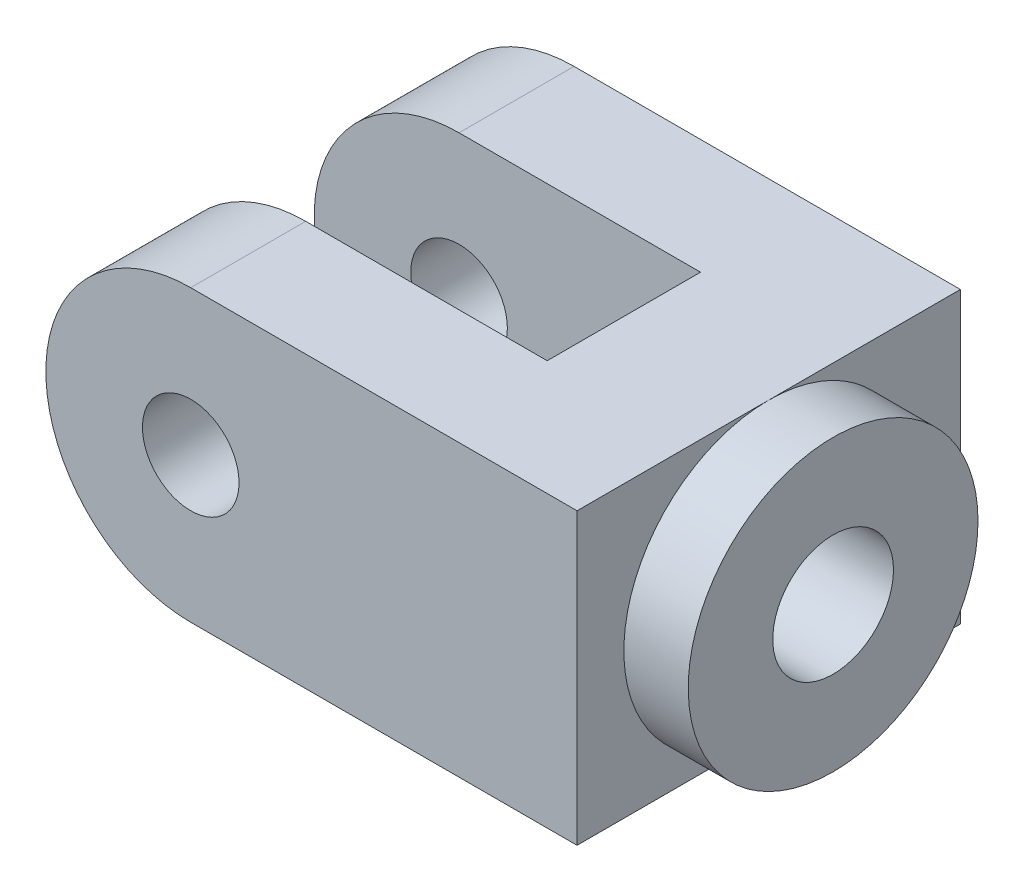
ISO-10303-21;
HEADER;
FILE_DESCRIPTION(('STEP AP214'),'2;1');
FILE_NAME('part.step','',(''),(''),'','','');
FILE_SCHEMA(('AUTOMOTIVE_DESIGN { 1 0 10303 214 1 1 1 1 }'));
ENDSEC;
DATA;
#1=APPLICATION_CONTEXT('core data for automotive mechanical design processes');
#2=APPLICATION_PROTOCOL_DEFINITION('international standard','automotive_design',2000,#1);
#3=PRODUCT_CONTEXT('',#1,'mechanical');
#4=PRODUCT('Part','Part','',(#3));
#5=PRODUCT_RELATED_PRODUCT_CATEGORY('part','',(#4));
#6=PRODUCT_DEFINITION_FORMATION('','',#4);
#7=PRODUCT_DEFINITION_CONTEXT('part definition',#1,'design');
#8=PRODUCT_DEFINITION('design','',#6,#7);
#9=PRODUCT_DEFINITION_SHAPE('','',#8);
#10=(LENGTH_UNIT() NAMED_UNIT(*) SI_UNIT(.MILLI.,.METRE.));
#11=(NAMED_UNIT(*) PLANE_ANGLE_UNIT() SI_UNIT($,.RADIAN.));
#12=(NAMED_UNIT(*) SI_UNIT($,.STERADIAN.) SOLID_ANGLE_UNIT());
#13=UNCERTAINTY_MEASURE_WITH_UNIT(LENGTH_MEASURE(1.E-05),#10,'distance_accuracy_value','');
#14=(GEOMETRIC_REPRESENTATION_CONTEXT(3) GLOBAL_UNCERTAINTY_ASSIGNED_CONTEXT((#13)) GLOBAL_UNIT_ASSIGNED_CONTEXT((#10,
#11,#12)) REPRESENTATION_CONTEXT('',''));
#15=CARTESIAN_POINT('',(0.,0.,0.));
#16=DIRECTION('',(0.,0.,1.));
#17=DIRECTION('',(1.,0.,0.));
#18=AXIS2_PLACEMENT_3D('',#15,#16,#17);
#19=CARTESIAN_POINT('',(66.,-36.,47.625));
#20=DIRECTION('',(-1.,0.,0.));
#21=DIRECTION('',(0.,0.,1.));
#22=AXIS2_PLACEMENT_3D('',#19,#20,#21);
#23=PLANE('',#22);
#24=CARTESIAN_POINT('',(66.,0.,0.));
#25=DIRECTION('',(1.,0.,0.));
#26=DIRECTION('',(0.,0.,-1.));
#27=AXIS2_PLACEMENT_3D('',#24,#25,#26);
#28=CIRCLE('',#27,36.);
#29=CARTESIAN_POINT('',(66.,36.,0.));
#30=VERTEX_POINT('',#29);
#31=CARTESIAN_POINT('',(66.,-36.,0.));
#32=VERTEX_POINT('',#31);
#33=EDGE_CURVE('E45',#30,#32,#28,.T.);
#34=ORIENTED_EDGE('',*,*,#33,.F.);
#35=DIRECTION('',(0.,0.,-1.));
#36=VECTOR('',#35,1.);
#37=CARTESIAN_POINT('',(66.,36.,47.625));
#38=LINE('',#37,#36);
#39=CARTESIAN_POINT('',(66.,36.,47.625));
#40=VERTEX_POINT('',#39);
#41=EDGE_CURVE('E107',#40,#30,#38,.T.);
#42=ORIENTED_EDGE('',*,*,#41,.F.);
#43=DIRECTION('',(0.,1.,0.));
#44=VECTOR('',#43,1.);
#45=CARTESIAN_POINT('',(66.,-36.,47.625));
#46=LINE('',#45,#44);
#47=CARTESIAN_POINT('',(66.,-36.,47.625));
#48=VERTEX_POINT('',#47);
#49=EDGE_CURVE('E238',#48,#40,#46,.T.);
#50=ORIENTED_EDGE('',*,*,#49,.F.);
#51=DIRECTION('',(0.,0.,-1.));
#52=VECTOR('',#51,1.);
#53=CARTESIAN_POINT('',(66.,-36.,47.625));
#54=LINE('',#53,#52);
#55=EDGE_CURVE('E123',#48,#32,#54,.T.);
#56=ORIENTED_EDGE('',*,*,#55,.T.);
#57=EDGE_LOOP('',(#34,#42,#50,#56));
#58=FACE_BOUND('',#57,.T.);
#59=ADVANCED_FACE('F34',(#58),#23,.F.);
#60=CARTESIAN_POINT('',(-30.,0.,389.175429799012));
#61=DIRECTION('',(0.,0.,-1.));
#62=DIRECTION('',(-1.,0.,0.));
#63=AXIS2_PLACEMENT_3D('',#60,#61,#62);
#64=CYLINDRICAL_SURFACE('',#63,36.0000000000001);
#65=DIRECTION('',(0.,0.,-1.));
#66=VECTOR('',#65,1.);
#67=CARTESIAN_POINT('',(-30.,36.,389.175429799012));
#68=LINE('',#67,#66);
#69=CARTESIAN_POINT('',(-30.,36.,47.625));
#70=VERTEX_POINT('',#69);
#71=CARTESIAN_POINT('',(-30.,36.,19.05));
#72=VERTEX_POINT('',#71);
#73=EDGE_CURVE('E234',#70,#72,#68,.T.);
#74=ORIENTED_EDGE('',*,*,#73,.T.);
#75=CARTESIAN_POINT('',(-30.,0.,19.05));
#76=DIRECTION('',(0.,0.,1.));
#77=DIRECTION('',(1.,0.,0.));
#78=AXIS2_PLACEMENT_3D('',#75,#76,#77);
#79=CIRCLE('',#78,36.0000000000001);
#80=CARTESIAN_POINT('',(-30.,-36.0000000000001,19.05));
#81=VERTEX_POINT('',#80);
#82=EDGE_CURVE('E227',#72,#81,#79,.T.);
#83=ORIENTED_EDGE('',*,*,#82,.T.);
#84=DIRECTION('',(0.,0.,-1.));
#85=VECTOR('',#84,1.);
#86=CARTESIAN_POINT('',(-30.0000030536262,-35.9999999999999,389.175429799012));
#87=LINE('',#86,#85);
#88=CARTESIAN_POINT('',(-30.,-36.,47.625));
#89=VERTEX_POINT('',#88);
#90=EDGE_CURVE('E230',#89,#81,#87,.T.);
#91=ORIENTED_EDGE('',*,*,#90,.F.);
#92=CARTESIAN_POINT('',(-30.,0.,47.625));
#93=DIRECTION('',(0.,0.,-1.));
#94=DIRECTION('',(-1.,0.,0.));
#95=AXIS2_PLACEMENT_3D('',#92,#93,#94);
#96=CIRCLE('',#95,36.0000000000001);
#97=EDGE_CURVE('E232',#70,#89,#96,.F.);
#98=ORIENTED_EDGE('',*,*,#97,.F.);
#99=EDGE_LOOP('',(#74,#83,#91,#98));
#100=FACE_BOUND('',#99,.T.);
#101=ADVANCED_FACE('F149',(#100),#64,.T.);
#102=CARTESIAN_POINT('',(-30.,0.,-19.05));
#103=DIRECTION('',(0.,0.,-1.));
#104=DIRECTION('',(-1.,0.,0.));
#105=AXIS2_PLACEMENT_3D('',#102,#103,#104);
#106=CIRCLE('',#105,36.0000000000001);
#107=CARTESIAN_POINT('',(-30.,-36.0000000000001,-19.05));
#108=VERTEX_POINT('',#107);
#109=CARTESIAN_POINT('',(-30.,36.,-19.05));
#110=VERTEX_POINT('',#109);
#111=EDGE_CURVE('E224',#108,#110,#106,.T.);
#112=ORIENTED_EDGE('',*,*,#111,.T.);
#113=CARTESIAN_POINT('',(-30.,36.,-47.625));
#114=VERTEX_POINT('',#113);
#115=EDGE_CURVE('E229',#110,#114,#68,.T.);
#116=ORIENTED_EDGE('',*,*,#115,.T.);
#117=CARTESIAN_POINT('',(-30.,0.,-47.625));
#118=DIRECTION('',(0.,0.,-1.));
#119=DIRECTION('',(-1.,0.,0.));
#120=AXIS2_PLACEMENT_3D('',#117,#118,#119);
#121=CIRCLE('',#120,36.0000000000001);
#122=CARTESIAN_POINT('',(-30.,-36.,-47.625));
#123=VERTEX_POINT('',#122);
#124=EDGE_CURVE('E118',#114,#123,#121,.F.);
#125=ORIENTED_EDGE('',*,*,#124,.T.);
#126=EDGE_CURVE('E233',#108,#123,#87,.T.);
#127=ORIENTED_EDGE('',*,*,#126,.F.);
#128=EDGE_LOOP('',(#112,#116,#125,#127));
#129=FACE_BOUND('',#128,.T.);
#130=ADVANCED_FACE('F153',(#129),#64,.T.);
#131=CARTESIAN_POINT('',(-66.,-36.,47.625));
#132=DIRECTION('',(0.,1.,0.));
#133=DIRECTION('',(0.,0.,1.));
#134=AXIS2_PLACEMENT_3D('',#131,#132,#133);
#135=PLANE('',#134);
#136=ORIENTED_EDGE('',*,*,#90,.T.);
#137=DIRECTION('',(1.,0.,0.));
#138=VECTOR('',#137,1.);
#139=CARTESIAN_POINT('',(30.,-36.0000000000001,19.05));
#140=LINE('',#139,#138);
#141=CARTESIAN_POINT('',(30.,-36.0000000000001,19.05));
#142=VERTEX_POINT('',#141);
#143=EDGE_CURVE('E215',#81,#142,#140,.T.);
#144=ORIENTED_EDGE('',*,*,#143,.T.);
#145=DIRECTION('',(0.,0.,-1.));
#146=VECTOR('',#145,1.);
#147=CARTESIAN_POINT('',(30.,-36.0000000000001,-19.05));
#148=LINE('',#147,#146);
#149=CARTESIAN_POINT('',(30.,-36.0000000000001,-19.05));
#150=VERTEX_POINT('',#149);
#151=EDGE_CURVE('E208',#142,#150,#148,.T.);
#152=ORIENTED_EDGE('',*,*,#151,.T.);
#153=DIRECTION('',(-1.,0.,0.));
#154=VECTOR('',#153,1.);
#155=CARTESIAN_POINT('',(30.,-36.0000000000001,-19.05));
#156=LINE('',#155,#154);
#157=EDGE_CURVE('E211',#150,#108,#156,.T.);
#158=ORIENTED_EDGE('',*,*,#157,.T.);
#159=ORIENTED_EDGE('',*,*,#126,.T.);
#160=DIRECTION('',(1.,0.,0.));
#161=VECTOR('',#160,1.);
#162=CARTESIAN_POINT('',(-66.,-36.,-47.625));
#163=LINE('',#162,#161);
#164=CARTESIAN_POINT('',(66.,-36.,-47.625));
#165=VERTEX_POINT('',#164);
#166=EDGE_CURVE('E240',#123,#165,#163,.T.);
#167=ORIENTED_EDGE('',*,*,#166,.T.);
#168=EDGE_CURVE('E244',#32,#165,#54,.T.);
#169=ORIENTED_EDGE('',*,*,#168,.F.);
#170=ORIENTED_EDGE('',*,*,#55,.F.);
#171=DIRECTION('',(1.,0.,0.));
#172=VECTOR('',#171,1.);
#173=CARTESIAN_POINT('',(-66.,-36.,47.625));
#174=LINE('',#173,#172);
#175=EDGE_CURVE('E242',#89,#48,#174,.T.);
#176=ORIENTED_EDGE('',*,*,#175,.F.);
#177=EDGE_LOOP('',(#136,#144,#152,#158,#159,#167,#169,#170,#176));
#178=FACE_BOUND('',#177,.T.);
#179=ADVANCED_FACE('F157',(#178),#135,.F.);
#180=EDGE_CURVE('E11',#32,#30,#28,.T.);
#181=ORIENTED_EDGE('',*,*,#180,.F.);
#182=ORIENTED_EDGE('',*,*,#168,.T.);
#183=DIRECTION('',(0.,1.,0.));
#184=VECTOR('',#183,1.);
#185=CARTESIAN_POINT('',(66.,-36.,-47.625));
#186=LINE('',#185,#184);
#187=CARTESIAN_POINT('',(66.,36.,-47.625));
#188=VERTEX_POINT('',#187);
#189=EDGE_CURVE('E122',#165,#188,#186,.T.);
#190=ORIENTED_EDGE('',*,*,#189,.T.);
#191=EDGE_CURVE('E110',#30,#188,#38,.T.);
#192=ORIENTED_EDGE('',*,*,#191,.F.);
#193=EDGE_LOOP('',(#181,#182,#190,#192));
#194=FACE_BOUND('',#193,.T.);
#195=ADVANCED_FACE('F36',(#194),#23,.F.);
#196=CARTESIAN_POINT('',(-66.,36.,47.625));
#197=DIRECTION('',(0.,-1.,0.));
#198=DIRECTION('',(0.,0.,-1.));
#199=AXIS2_PLACEMENT_3D('',#196,#197,#198);
#200=PLANE('',#199);
#201=DIRECTION('',(0.,0.,-1.));
#202=VECTOR('',#201,1.);
#203=CARTESIAN_POINT('',(30.,36.,-19.05));
#204=LINE('',#203,#202);
#205=CARTESIAN_POINT('',(30.,36.,19.05));
#206=VERTEX_POINT('',#205);
#207=CARTESIAN_POINT('',(30.,36.,-19.05));
#208=VERTEX_POINT('',#207);
#209=EDGE_CURVE('E58',#206,#208,#204,.T.);
#210=ORIENTED_EDGE('',*,*,#209,.F.);
#211=DIRECTION('',(-1.,0.,0.));
#212=VECTOR('',#211,1.);
#213=CARTESIAN_POINT('',(-66.,36.,19.05));
#214=LINE('',#213,#212);
#215=EDGE_CURVE('E43',#206,#72,#214,.T.);
#216=ORIENTED_EDGE('',*,*,#215,.T.);
#217=ORIENTED_EDGE('',*,*,#73,.F.);
#218=DIRECTION('',(-1.,0.,0.));
#219=VECTOR('',#218,1.);
#220=CARTESIAN_POINT('',(-66.,36.,47.625));
#221=LINE('',#220,#219);
#222=EDGE_CURVE('E113',#40,#70,#221,.T.);
#223=ORIENTED_EDGE('',*,*,#222,.F.);
#224=ORIENTED_EDGE('',*,*,#41,.T.);
#225=ORIENTED_EDGE('',*,*,#191,.T.);
#226=DIRECTION('',(-1.,0.,0.));
#227=VECTOR('',#226,1.);
#228=CARTESIAN_POINT('',(-66.,36.,-47.625));
#229=LINE('',#228,#227);
#230=EDGE_CURVE('E246',#188,#114,#229,.T.);
#231=ORIENTED_EDGE('',*,*,#230,.T.);
#232=ORIENTED_EDGE('',*,*,#115,.F.);
#233=DIRECTION('',(-1.,0.,0.));
#234=VECTOR('',#233,1.);
#235=CARTESIAN_POINT('',(30.,36.,-19.05));
#236=LINE('',#235,#234);
#237=EDGE_CURVE('E212',#208,#110,#236,.T.);
#238=ORIENTED_EDGE('',*,*,#237,.F.);
#239=EDGE_LOOP('',(#210,#216,#217,#223,#224,#225,#231,#232,#238));
#240=FACE_BOUND('',#239,.T.);
#241=ADVANCED_FACE('F108',(#240),#200,.F.);
#242=CARTESIAN_POINT('',(0.,0.,47.625));
#243=DIRECTION('',(0.,0.,-1.));
#244=DIRECTION('',(-1.,0.,0.));
#245=AXIS2_PLACEMENT_3D('',#242,#243,#244);
#246=PLANE('',#245);
#247=CARTESIAN_POINT('',(-30.,0.,47.625));
#248=DIRECTION('',(0.,0.,1.));
#249=DIRECTION('',(1.,0.,0.));
#250=AXIS2_PLACEMENT_3D('',#247,#248,#249);
#251=CIRCLE('',#250,12.);
#252=CARTESIAN_POINT('',(-18.,0.,47.625));
#253=VERTEX_POINT('',#252);
#254=EDGE_CURVE('E269',#253,#253,#251,.T.);
#255=ORIENTED_EDGE('',*,*,#254,.F.);
#256=EDGE_LOOP('',(#255));
#257=FACE_BOUND('',#256,.T.);
#258=ORIENTED_EDGE('',*,*,#97,.T.);
#259=ORIENTED_EDGE('',*,*,#175,.T.);
#260=ORIENTED_EDGE('',*,*,#49,.T.);
#261=ORIENTED_EDGE('',*,*,#222,.T.);
#262=EDGE_LOOP('',(#258,#259,#260,#261));
#263=FACE_BOUND('',#262,.T.);
#264=ADVANCED_FACE('F162',(#257,#263),#246,.F.);
#265=CARTESIAN_POINT('',(0.,0.,-47.625));
#266=DIRECTION('',(0.,0.,-1.));
#267=DIRECTION('',(-1.,0.,0.));
#268=AXIS2_PLACEMENT_3D('',#265,#266,#267);
#269=PLANE('',#268);
#270=CARTESIAN_POINT('',(-30.,0.,-47.625));
#271=DIRECTION('',(0.,0.,1.));
#272=DIRECTION('',(1.,0.,0.));
#273=AXIS2_PLACEMENT_3D('',#270,#271,#272);
#274=CIRCLE('',#273,12.);
#275=CARTESIAN_POINT('',(-18.,0.,-47.625));
#276=VERTEX_POINT('',#275);
#277=EDGE_CURVE('E272',#276,#276,#274,.T.);
#278=ORIENTED_EDGE('',*,*,#277,.T.);
#279=EDGE_LOOP('',(#278));
#280=FACE_BOUND('',#279,.T.);
#281=ORIENTED_EDGE('',*,*,#166,.F.);
#282=ORIENTED_EDGE('',*,*,#124,.F.);
#283=ORIENTED_EDGE('',*,*,#230,.F.);
#284=ORIENTED_EDGE('',*,*,#189,.F.);
#285=EDGE_LOOP('',(#281,#282,#283,#284));
#286=FACE_BOUND('',#285,.T.);
#287=ADVANCED_FACE('F171',(#280,#286),#269,.T.);
#288=CARTESIAN_POINT('',(30.,-36.0000000000001,19.05));
#289=DIRECTION('',(0.,0.,1.));
#290=DIRECTION('',(1.,0.,0.));
#291=AXIS2_PLACEMENT_3D('',#288,#289,#290);
#292=PLANE('',#291);
#293=CARTESIAN_POINT('',(-30.,0.,19.05));
#294=DIRECTION('',(0.,0.,1.));
#295=DIRECTION('',(1.,0.,0.));
#296=AXIS2_PLACEMENT_3D('',#293,#294,#295);
#297=CIRCLE('',#296,12.);
#298=CARTESIAN_POINT('',(-18.,0.,19.05));
#299=VERTEX_POINT('',#298);
#300=EDGE_CURVE('E200',#299,#299,#297,.T.);
#301=ORIENTED_EDGE('',*,*,#300,.T.);
#302=EDGE_LOOP('',(#301));
#303=FACE_BOUND('',#302,.T.);
#304=ORIENTED_EDGE('',*,*,#215,.F.);
#305=DIRECTION('',(0.,1.,0.));
#306=VECTOR('',#305,1.);
#307=CARTESIAN_POINT('',(30.,-36.0000000000001,19.05));
#308=LINE('',#307,#306);
#309=EDGE_CURVE('E222',#142,#206,#308,.T.);
#310=ORIENTED_EDGE('',*,*,#309,.F.);
#311=ORIENTED_EDGE('',*,*,#143,.F.);
#312=ORIENTED_EDGE('',*,*,#82,.F.);
#313=EDGE_LOOP('',(#304,#310,#311,#312));
#314=FACE_BOUND('',#313,.T.);
#315=ADVANCED_FACE('F174',(#303,#314),#292,.F.);
#316=CARTESIAN_POINT('',(30.,-36.0000000000001,-19.05));
#317=DIRECTION('',(0.,0.,-1.));
#318=DIRECTION('',(-1.,0.,0.));
#319=AXIS2_PLACEMENT_3D('',#316,#317,#318);
#320=PLANE('',#319);
#321=CARTESIAN_POINT('',(-30.,0.,-19.05));
#322=DIRECTION('',(0.,0.,-1.));
#323=DIRECTION('',(-1.,0.,0.));
#324=AXIS2_PLACEMENT_3D('',#321,#322,#323);
#325=CIRCLE('',#324,12.);
#326=CARTESIAN_POINT('',(-42.,0.,-19.05));
#327=VERTEX_POINT('',#326);
#328=EDGE_CURVE('E38',#327,#327,#325,.T.);
#329=ORIENTED_EDGE('',*,*,#328,.T.);
#330=EDGE_LOOP('',(#329));
#331=FACE_BOUND('',#330,.T.);
#332=ORIENTED_EDGE('',*,*,#111,.F.);
#333=ORIENTED_EDGE('',*,*,#157,.F.);
#334=DIRECTION('',(0.,1.,0.));
#335=VECTOR('',#334,1.);
#336=CARTESIAN_POINT('',(30.,-36.0000000000001,-19.05));
#337=LINE('',#336,#335);
#338=EDGE_CURVE('E218',#150,#208,#337,.T.);
#339=ORIENTED_EDGE('',*,*,#338,.T.);
#340=ORIENTED_EDGE('',*,*,#237,.T.);
#341=EDGE_LOOP('',(#332,#333,#339,#340));
#342=FACE_BOUND('',#341,.T.);
#343=ADVANCED_FACE('F182',(#331,#342),#320,.F.);
#344=CARTESIAN_POINT('',(30.,-36.0000000000001,-19.05));
#345=DIRECTION('',(1.,0.,0.));
#346=DIRECTION('',(0.,0.,-1.));
#347=AXIS2_PLACEMENT_3D('',#344,#345,#346);
#348=PLANE('',#347);
#349=CARTESIAN_POINT('',(30.,0.,0.));
#350=DIRECTION('',(1.,0.,0.));
#351=DIRECTION('',(0.,0.,-1.));
#352=AXIS2_PLACEMENT_3D('',#349,#350,#351);
#353=CIRCLE('',#352,15.);
#354=CARTESIAN_POINT('',(30.,0.,-15.));
#355=VERTEX_POINT('',#354);
#356=EDGE_CURVE('E196',#355,#355,#353,.T.);
#357=ORIENTED_EDGE('',*,*,#356,.T.);
#358=EDGE_LOOP('',(#357));
#359=FACE_BOUND('',#358,.T.);
#360=ORIENTED_EDGE('',*,*,#209,.T.);
#361=ORIENTED_EDGE('',*,*,#338,.F.);
#362=ORIENTED_EDGE('',*,*,#151,.F.);
#363=ORIENTED_EDGE('',*,*,#309,.T.);
#364=EDGE_LOOP('',(#360,#361,#362,#363));
#365=FACE_BOUND('',#364,.T.);
#366=ADVANCED_FACE('F179',(#359,#365),#348,.F.);
#367=CARTESIAN_POINT('',(-66.0000000000001,0.,0.));
#368=DIRECTION('',(1.,0.,0.));
#369=DIRECTION('',(0.,0.,-1.));
#370=AXIS2_PLACEMENT_3D('',#367,#368,#369);
#371=CYLINDRICAL_SURFACE('',#370,15.);
#372=ORIENTED_EDGE('',*,*,#356,.F.);
#373=EDGE_LOOP('',(#372));
#374=FACE_BOUND('',#373,.T.);
#375=CARTESIAN_POINT('',(82.,0.,0.));
#376=DIRECTION('',(1.,0.,0.));
#377=DIRECTION('',(0.,0.,-1.));
#378=AXIS2_PLACEMENT_3D('',#375,#376,#377);
#379=CIRCLE('',#378,15.);
#380=CARTESIAN_POINT('',(82.,0.,-15.));
#381=VERTEX_POINT('',#380);
#382=EDGE_CURVE('E129',#381,#381,#379,.T.);
#383=ORIENTED_EDGE('',*,*,#382,.T.);
#384=EDGE_LOOP('',(#383));
#385=FACE_BOUND('',#384,.T.);
#386=ADVANCED_FACE('F143',(#374,#385),#371,.F.);
#387=CARTESIAN_POINT('',(82.,0.,0.));
#388=DIRECTION('',(1.,0.,0.));
#389=DIRECTION('',(0.,0.,-1.));
#390=AXIS2_PLACEMENT_3D('',#387,#388,#389);
#391=PLANE('',#390);
#392=CARTESIAN_POINT('',(82.,0.,0.));
#393=DIRECTION('',(1.,0.,0.));
#394=DIRECTION('',(0.,0.,-1.));
#395=AXIS2_PLACEMENT_3D('',#392,#393,#394);
#396=CIRCLE('',#395,36.);
#397=CARTESIAN_POINT('',(82.,0.,-36.));
#398=VERTEX_POINT('',#397);
#399=EDGE_CURVE('E128',#398,#398,#396,.T.);
#400=ORIENTED_EDGE('',*,*,#399,.T.);
#401=EDGE_LOOP('',(#400));
#402=FACE_BOUND('',#401,.T.);
#403=ORIENTED_EDGE('',*,*,#382,.F.);
#404=EDGE_LOOP('',(#403));
#405=FACE_BOUND('',#404,.T.);
#406=ADVANCED_FACE('F133',(#402,#405),#391,.T.);
#407=CARTESIAN_POINT('',(82.,0.,0.));
#408=DIRECTION('',(-1.,0.,0.));
#409=DIRECTION('',(0.,0.,1.));
#410=AXIS2_PLACEMENT_3D('',#407,#408,#409);
#411=CYLINDRICAL_SURFACE('',#410,36.);
#412=ORIENTED_EDGE('',*,*,#399,.F.);
#413=EDGE_LOOP('',(#412));
#414=FACE_BOUND('',#413,.T.);
#415=ORIENTED_EDGE('',*,*,#33,.T.);
#416=ORIENTED_EDGE('',*,*,#180,.T.);
#417=EDGE_LOOP('',(#415,#416));
#418=FACE_BOUND('',#417,.T.);
#419=ADVANCED_FACE('F130',(#414,#418),#411,.T.);
#420=CARTESIAN_POINT('',(-30.,0.,-47.625));
#421=DIRECTION('',(0.,0.,1.));
#422=DIRECTION('',(1.,0.,0.));
#423=AXIS2_PLACEMENT_3D('',#420,#421,#422);
#424=CYLINDRICAL_SURFACE('',#423,12.);
#425=ORIENTED_EDGE('',*,*,#277,.F.);
#426=EDGE_LOOP('',(#425));
#427=FACE_BOUND('',#426,.T.);
#428=ORIENTED_EDGE('',*,*,#328,.F.);
#429=EDGE_LOOP('',(#428));
#430=FACE_BOUND('',#429,.T.);
#431=ADVANCED_FACE('F132',(#427,#430),#424,.F.);
#432=ORIENTED_EDGE('',*,*,#254,.T.);
#433=EDGE_LOOP('',(#432));
#434=FACE_BOUND('',#433,.T.);
#435=ORIENTED_EDGE('',*,*,#300,.F.);
#436=EDGE_LOOP('',(#435));
#437=FACE_BOUND('',#436,.T.);
#438=ADVANCED_FACE('F140',(#434,#437),#424,.F.);
#439=CLOSED_SHELL('',(#59,#101,#130,#179,#195,#241,#264,#287,#315,#343,#366,#386,#406,#419,#431,#438));
#440=MANIFOLD_SOLID_BREP('B2',#439);
#441=ADVANCED_BREP_SHAPE_REPRESENTATION('',(#18,#440),#14);
#442=SHAPE_DEFINITION_REPRESENTATION(#9,#441);
ENDSEC;
END-ISO-10303-21;
